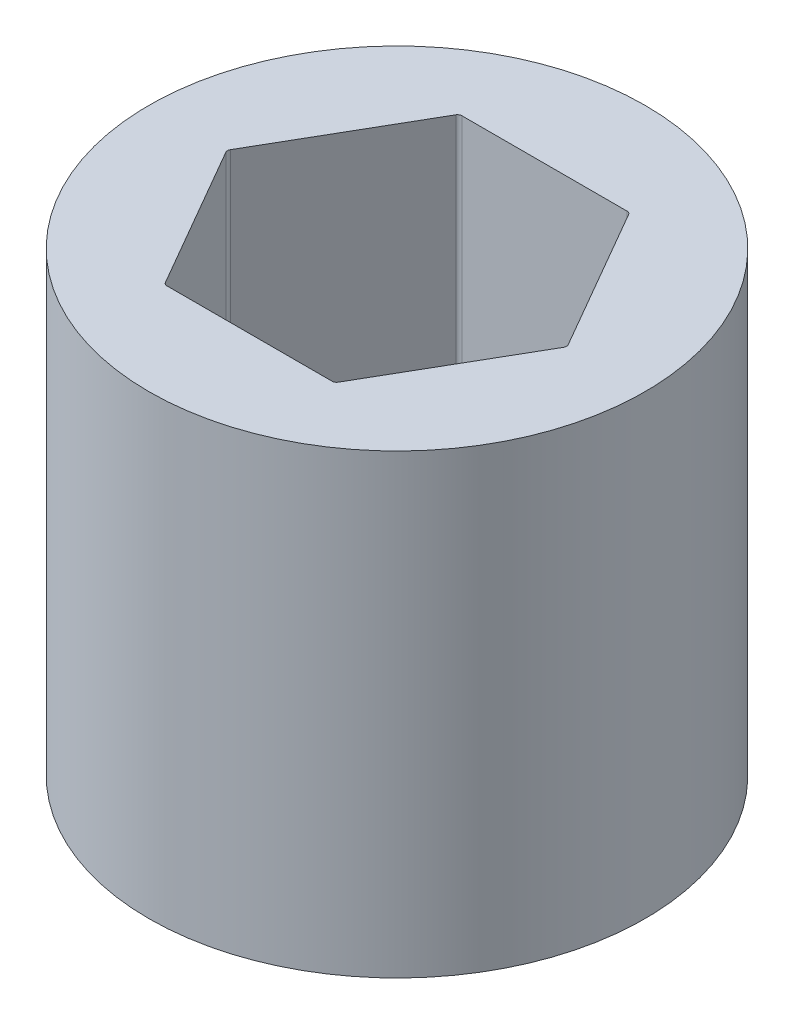
ISO-10303-21;
HEADER;
FILE_DESCRIPTION(('STEP AP214'),'2;1');
FILE_NAME('part.step','',(''),(''),'','','');
FILE_SCHEMA(('AUTOMOTIVE_DESIGN { 1 0 10303 214 1 1 1 1 }'));
ENDSEC;
DATA;
#1=APPLICATION_CONTEXT('core data for automotive mechanical design processes');
#2=APPLICATION_PROTOCOL_DEFINITION('international standard','automotive_design',2000,#1);
#3=PRODUCT_CONTEXT('',#1,'mechanical');
#4=PRODUCT('Part','Part','',(#3));
#5=PRODUCT_RELATED_PRODUCT_CATEGORY('part','',(#4));
#6=PRODUCT_DEFINITION_FORMATION('','',#4);
#7=PRODUCT_DEFINITION_CONTEXT('part definition',#1,'design');
#8=PRODUCT_DEFINITION('design','',#6,#7);
#9=PRODUCT_DEFINITION_SHAPE('','',#8);
#10=(LENGTH_UNIT() NAMED_UNIT(*) SI_UNIT(.MILLI.,.METRE.));
#11=(NAMED_UNIT(*) PLANE_ANGLE_UNIT() SI_UNIT($,.RADIAN.));
#12=(NAMED_UNIT(*) SI_UNIT($,.STERADIAN.) SOLID_ANGLE_UNIT());
#13=UNCERTAINTY_MEASURE_WITH_UNIT(LENGTH_MEASURE(1.E-05),#10,'distance_accuracy_value','');
#14=(GEOMETRIC_REPRESENTATION_CONTEXT(3) GLOBAL_UNCERTAINTY_ASSIGNED_CONTEXT((#13)) GLOBAL_UNIT_ASSIGNED_CONTEXT((#10,
#11,#12)) REPRESENTATION_CONTEXT('',''));
#15=CARTESIAN_POINT('',(0.,0.,0.));
#16=DIRECTION('',(0.,0.,1.));
#17=DIRECTION('',(1.,0.,0.));
#18=AXIS2_PLACEMENT_3D('',#15,#16,#17);
#19=CARTESIAN_POINT('',(0.,20.447,0.));
#20=DIRECTION('',(0.,1.,0.));
#21=DIRECTION('',(0.,0.,1.));
#22=AXIS2_PLACEMENT_3D('',#19,#20,#21);
#23=PLANE('',#22);
#24=CARTESIAN_POINT('',(0.,20.447,0.));
#25=DIRECTION('',(0.,1.,0.));
#26=DIRECTION('',(0.,0.,1.));
#27=AXIS2_PLACEMENT_3D('',#24,#25,#26);
#28=CIRCLE('',#27,11.1125);
#29=CARTESIAN_POINT('',(0.,20.447,11.1125));
#30=VERTEX_POINT('',#29);
#31=EDGE_CURVE('E149',#30,#30,#28,.T.);
#32=ORIENTED_EDGE('',*,*,#31,.T.);
#33=EDGE_LOOP('',(#32));
#34=FACE_BOUND('',#33,.T.);
#35=DIRECTION('',(-0.5,0.,-0.866025403784438));
#36=VECTOR('',#35,1.);
#37=CARTESIAN_POINT('',(7.62564235545658,20.447,0.));
#38=LINE('',#37,#36);
#39=CARTESIAN_POINT('',(7.56790732853761,20.447,-0.100000000000001));
#40=VERTEX_POINT('',#39);
#41=CARTESIAN_POINT('',(3.87055620464725,20.447,-6.504));
#42=VERTEX_POINT('',#41);
#43=EDGE_CURVE('E250',#40,#42,#38,.T.);
#44=ORIENTED_EDGE('',*,*,#43,.F.);
#45=CARTESIAN_POINT('',(7.39470224778073,20.447,0.));
#46=DIRECTION('',(0.,1.,0.));
#47=DIRECTION('',(0.,0.,1.));
#48=AXIS2_PLACEMENT_3D('',#45,#46,#47);
#49=CIRCLE('',#48,0.2);
#50=CARTESIAN_POINT('',(7.56790732853761,20.447,0.0999999999999977));
#51=VERTEX_POINT('',#50);
#52=EDGE_CURVE('E52',#40,#51,#49,.F.);
#53=ORIENTED_EDGE('',*,*,#52,.T.);
#54=DIRECTION('',(0.5,0.,-0.866025403784439));
#55=VECTOR('',#54,1.);
#56=CARTESIAN_POINT('',(3.81282117772829,20.447,6.604));
#57=LINE('',#56,#55);
#58=CARTESIAN_POINT('',(3.87055620464725,20.447,6.50400000000001));
#59=VERTEX_POINT('',#58);
#60=EDGE_CURVE('E208',#59,#51,#57,.T.);
#61=ORIENTED_EDGE('',*,*,#60,.F.);
#62=CARTESIAN_POINT('',(3.69735112389036,20.447,6.40400000000001));
#63=DIRECTION('',(0.,1.,0.));
#64=DIRECTION('',(0.,0.,1.));
#65=AXIS2_PLACEMENT_3D('',#62,#63,#64);
#66=CIRCLE('',#65,0.2);
#67=CARTESIAN_POINT('',(3.69735112389036,20.447,6.604));
#68=VERTEX_POINT('',#67);
#69=EDGE_CURVE('E137',#59,#68,#66,.F.);
#70=ORIENTED_EDGE('',*,*,#69,.T.);
#71=DIRECTION('',(1.,0.,0.));
#72=VECTOR('',#71,1.);
#73=CARTESIAN_POINT('',(-3.81282117772829,20.447,6.604));
#74=LINE('',#73,#72);
#75=CARTESIAN_POINT('',(-3.69735112389036,20.447,6.604));
#76=VERTEX_POINT('',#75);
#77=EDGE_CURVE('E215',#76,#68,#74,.T.);
#78=ORIENTED_EDGE('',*,*,#77,.F.);
#79=CARTESIAN_POINT('',(-3.69735112389036,20.447,6.40400000000001));
#80=DIRECTION('',(0.,1.,0.));
#81=DIRECTION('',(0.,0.,1.));
#82=AXIS2_PLACEMENT_3D('',#79,#80,#81);
#83=CIRCLE('',#82,0.2);
#84=CARTESIAN_POINT('',(-3.87055620464725,20.447,6.50400000000001));
#85=VERTEX_POINT('',#84);
#86=EDGE_CURVE('E11',#76,#85,#83,.F.);
#87=ORIENTED_EDGE('',*,*,#86,.T.);
#88=DIRECTION('',(0.5,0.,0.866025403784439));
#89=VECTOR('',#88,1.);
#90=CARTESIAN_POINT('',(-7.62564235545658,20.447,0.));
#91=LINE('',#90,#89);
#92=CARTESIAN_POINT('',(-7.56790732853762,20.447,0.1));
#93=VERTEX_POINT('',#92);
#94=EDGE_CURVE('E213',#93,#85,#91,.T.);
#95=ORIENTED_EDGE('',*,*,#94,.F.);
#96=CARTESIAN_POINT('',(-7.39470224778073,20.447,0.));
#97=DIRECTION('',(0.,1.,0.));
#98=DIRECTION('',(0.,0.,1.));
#99=AXIS2_PLACEMENT_3D('',#96,#97,#98);
#100=CIRCLE('',#99,0.2);
#101=CARTESIAN_POINT('',(-7.56790732853762,20.447,-0.0999999999999994));
#102=VERTEX_POINT('',#101);
#103=EDGE_CURVE('E190',#93,#102,#100,.F.);
#104=ORIENTED_EDGE('',*,*,#103,.T.);
#105=DIRECTION('',(-0.5,0.,0.866025403784439));
#106=VECTOR('',#105,1.);
#107=CARTESIAN_POINT('',(-3.81282117772829,20.447,-6.604));
#108=LINE('',#107,#106);
#109=CARTESIAN_POINT('',(-3.87055620464725,20.447,-6.504));
#110=VERTEX_POINT('',#109);
#111=EDGE_CURVE('E219',#110,#102,#108,.T.);
#112=ORIENTED_EDGE('',*,*,#111,.F.);
#113=CARTESIAN_POINT('',(-3.69735112389037,20.447,-6.404));
#114=DIRECTION('',(0.,1.,0.));
#115=DIRECTION('',(0.,0.,1.));
#116=AXIS2_PLACEMENT_3D('',#113,#114,#115);
#117=CIRCLE('',#116,0.2);
#118=CARTESIAN_POINT('',(-3.69735112389037,20.447,-6.604));
#119=VERTEX_POINT('',#118);
#120=EDGE_CURVE('E186',#110,#119,#117,.F.);
#121=ORIENTED_EDGE('',*,*,#120,.T.);
#122=DIRECTION('',(-1.,0.,0.));
#123=VECTOR('',#122,1.);
#124=CARTESIAN_POINT('',(3.81282117772829,20.447,-6.604));
#125=LINE('',#124,#123);
#126=CARTESIAN_POINT('',(3.69735112389036,20.447,-6.604));
#127=VERTEX_POINT('',#126);
#128=EDGE_CURVE('E223',#127,#119,#125,.T.);
#129=ORIENTED_EDGE('',*,*,#128,.F.);
#130=CARTESIAN_POINT('',(3.69735112389036,20.447,-6.404));
#131=DIRECTION('',(0.,1.,0.));
#132=DIRECTION('',(0.,0.,1.));
#133=AXIS2_PLACEMENT_3D('',#130,#131,#132);
#134=CIRCLE('',#133,0.2);
#135=EDGE_CURVE('E182',#127,#42,#134,.F.);
#136=ORIENTED_EDGE('',*,*,#135,.T.);
#137=EDGE_LOOP('',(#44,#53,#61,#70,#78,#87,#95,#104,#112,#121,#129,#136));
#138=FACE_BOUND('',#137,.T.);
#139=ADVANCED_FACE('F37',(#34,#138),#23,.T.);
#140=CARTESIAN_POINT('',(0.,0.,0.));
#141=DIRECTION('',(0.,1.,0.));
#142=DIRECTION('',(0.,0.,1.));
#143=AXIS2_PLACEMENT_3D('',#140,#141,#142);
#144=PLANE('',#143);
#145=CARTESIAN_POINT('',(0.,0.,0.));
#146=DIRECTION('',(0.,1.,0.));
#147=DIRECTION('',(0.,0.,1.));
#148=AXIS2_PLACEMENT_3D('',#145,#146,#147);
#149=CIRCLE('',#148,11.1125);
#150=CARTESIAN_POINT('',(0.,0.,11.1125));
#151=VERTEX_POINT('',#150);
#152=EDGE_CURVE('E154',#151,#151,#149,.T.);
#153=ORIENTED_EDGE('',*,*,#152,.F.);
#154=EDGE_LOOP('',(#153));
#155=FACE_BOUND('',#154,.T.);
#156=DIRECTION('',(1.,0.,0.));
#157=VECTOR('',#156,1.);
#158=CARTESIAN_POINT('',(-3.81282117772829,0.,6.604));
#159=LINE('',#158,#157);
#160=CARTESIAN_POINT('',(-3.69735112389036,0.,6.604));
#161=VERTEX_POINT('',#160);
#162=CARTESIAN_POINT('',(3.69735112389036,0.,6.604));
#163=VERTEX_POINT('',#162);
#164=EDGE_CURVE('E197',#161,#163,#159,.T.);
#165=ORIENTED_EDGE('',*,*,#164,.T.);
#166=CARTESIAN_POINT('',(3.69735112389036,0.,6.40400000000001));
#167=DIRECTION('',(0.,1.,0.));
#168=DIRECTION('',(0.,0.,1.));
#169=AXIS2_PLACEMENT_3D('',#166,#167,#168);
#170=CIRCLE('',#169,0.2);
#171=CARTESIAN_POINT('',(3.87055620464725,0.,6.50400000000001));
#172=VERTEX_POINT('',#171);
#173=EDGE_CURVE('E192',#163,#172,#170,.T.);
#174=ORIENTED_EDGE('',*,*,#173,.T.);
#175=DIRECTION('',(0.5,0.,-0.866025403784439));
#176=VECTOR('',#175,1.);
#177=CARTESIAN_POINT('',(3.81282117772829,0.,6.604));
#178=LINE('',#177,#176);
#179=CARTESIAN_POINT('',(7.56790732853761,0.,0.0999999999999977));
#180=VERTEX_POINT('',#179);
#181=EDGE_CURVE('E132',#172,#180,#178,.T.);
#182=ORIENTED_EDGE('',*,*,#181,.T.);
#183=CARTESIAN_POINT('',(7.39470224778073,0.,0.));
#184=DIRECTION('',(0.,1.,0.));
#185=DIRECTION('',(0.,0.,1.));
#186=AXIS2_PLACEMENT_3D('',#183,#184,#185);
#187=CIRCLE('',#186,0.2);
#188=CARTESIAN_POINT('',(7.56790732853761,0.,-0.100000000000001));
#189=VERTEX_POINT('',#188);
#190=EDGE_CURVE('E127',#180,#189,#187,.T.);
#191=ORIENTED_EDGE('',*,*,#190,.T.);
#192=DIRECTION('',(-0.5,0.,-0.866025403784438));
#193=VECTOR('',#192,1.);
#194=CARTESIAN_POINT('',(7.62564235545658,0.,0.));
#195=LINE('',#194,#193);
#196=CARTESIAN_POINT('',(3.87055620464725,0.,-6.504));
#197=VERTEX_POINT('',#196);
#198=EDGE_CURVE('E131',#189,#197,#195,.T.);
#199=ORIENTED_EDGE('',*,*,#198,.T.);
#200=CARTESIAN_POINT('',(3.69735112389036,0.,-6.404));
#201=DIRECTION('',(0.,1.,0.));
#202=DIRECTION('',(0.,0.,1.));
#203=AXIS2_PLACEMENT_3D('',#200,#201,#202);
#204=CIRCLE('',#203,0.2);
#205=CARTESIAN_POINT('',(3.69735112389036,0.,-6.604));
#206=VERTEX_POINT('',#205);
#207=EDGE_CURVE('E180',#197,#206,#204,.T.);
#208=ORIENTED_EDGE('',*,*,#207,.T.);
#209=DIRECTION('',(-1.,0.,0.));
#210=VECTOR('',#209,1.);
#211=CARTESIAN_POINT('',(3.81282117772829,0.,-6.604));
#212=LINE('',#211,#210);
#213=CARTESIAN_POINT('',(-3.69735112389037,0.,-6.604));
#214=VERTEX_POINT('',#213);
#215=EDGE_CURVE('E146',#206,#214,#212,.T.);
#216=ORIENTED_EDGE('',*,*,#215,.T.);
#217=CARTESIAN_POINT('',(-3.69735112389037,0.,-6.404));
#218=DIRECTION('',(0.,1.,0.));
#219=DIRECTION('',(0.,0.,1.));
#220=AXIS2_PLACEMENT_3D('',#217,#218,#219);
#221=CIRCLE('',#220,0.2);
#222=CARTESIAN_POINT('',(-3.87055620464725,0.,-6.504));
#223=VERTEX_POINT('',#222);
#224=EDGE_CURVE('E184',#214,#223,#221,.T.);
#225=ORIENTED_EDGE('',*,*,#224,.T.);
#226=DIRECTION('',(-0.5,0.,0.866025403784439));
#227=VECTOR('',#226,1.);
#228=CARTESIAN_POINT('',(-3.81282117772829,0.,-6.604));
#229=LINE('',#228,#227);
#230=CARTESIAN_POINT('',(-7.56790732853762,0.,-0.0999999999999994));
#231=VERTEX_POINT('',#230);
#232=EDGE_CURVE('E230',#223,#231,#229,.T.);
#233=ORIENTED_EDGE('',*,*,#232,.T.);
#234=CARTESIAN_POINT('',(-7.39470224778073,0.,0.));
#235=DIRECTION('',(0.,1.,0.));
#236=DIRECTION('',(0.,0.,1.));
#237=AXIS2_PLACEMENT_3D('',#234,#235,#236);
#238=CIRCLE('',#237,0.2);
#239=CARTESIAN_POINT('',(-7.56790732853762,0.,0.1));
#240=VERTEX_POINT('',#239);
#241=EDGE_CURVE('E188',#231,#240,#238,.T.);
#242=ORIENTED_EDGE('',*,*,#241,.T.);
#243=DIRECTION('',(0.5,0.,0.866025403784439));
#244=VECTOR('',#243,1.);
#245=CARTESIAN_POINT('',(-7.62564235545658,0.,0.));
#246=LINE('',#245,#244);
#247=CARTESIAN_POINT('',(-3.87055620464725,0.,6.50400000000001));
#248=VERTEX_POINT('',#247);
#249=EDGE_CURVE('E199',#240,#248,#246,.T.);
#250=ORIENTED_EDGE('',*,*,#249,.T.);
#251=CARTESIAN_POINT('',(-3.69735112389036,0.,6.40400000000001));
#252=DIRECTION('',(0.,1.,0.));
#253=DIRECTION('',(0.,0.,1.));
#254=AXIS2_PLACEMENT_3D('',#251,#252,#253);
#255=CIRCLE('',#254,0.2);
#256=EDGE_CURVE('E45',#248,#161,#255,.T.);
#257=ORIENTED_EDGE('',*,*,#256,.T.);
#258=EDGE_LOOP('',(#165,#174,#182,#191,#199,#208,#216,#225,#233,#242,#250,#257));
#259=FACE_BOUND('',#258,.T.);
#260=ADVANCED_FACE('F130',(#155,#259),#144,.F.);
#261=CARTESIAN_POINT('',(0.,20.447,0.));
#262=DIRECTION('',(0.,-1.,0.));
#263=DIRECTION('',(0.,0.,-1.));
#264=AXIS2_PLACEMENT_3D('',#261,#262,#263);
#265=CYLINDRICAL_SURFACE('',#264,11.1125);
#266=ORIENTED_EDGE('',*,*,#31,.F.);
#267=EDGE_LOOP('',(#266));
#268=FACE_BOUND('',#267,.T.);
#269=ORIENTED_EDGE('',*,*,#152,.T.);
#270=EDGE_LOOP('',(#269));
#271=FACE_BOUND('',#270,.T.);
#272=ADVANCED_FACE('F272',(#268,#271),#265,.T.);
#273=CARTESIAN_POINT('',(3.81282117772829,20.447,6.604));
#274=DIRECTION('',(-0.866025403784439,0.,-0.5));
#275=DIRECTION('',(-0.5,0.,0.866025403784439));
#276=AXIS2_PLACEMENT_3D('',#273,#274,#275);
#277=PLANE('',#276);
#278=ORIENTED_EDGE('',*,*,#181,.F.);
#279=DIRECTION('',(0.,-1.,0.));
#280=VECTOR('',#279,1.);
#281=CARTESIAN_POINT('',(3.87055620464725,20.447,6.50400000000001));
#282=LINE('',#281,#280);
#283=EDGE_CURVE('E59',#172,#59,#282,.F.);
#284=ORIENTED_EDGE('',*,*,#283,.T.);
#285=ORIENTED_EDGE('',*,*,#60,.T.);
#286=DIRECTION('',(0.,-1.,0.));
#287=VECTOR('',#286,1.);
#288=CARTESIAN_POINT('',(7.56790732853762,0.,0.0999999999999983));
#289=LINE('',#288,#287);
#290=EDGE_CURVE('E177',#51,#180,#289,.T.);
#291=ORIENTED_EDGE('',*,*,#290,.T.);
#292=EDGE_LOOP('',(#278,#284,#285,#291));
#293=FACE_BOUND('',#292,.T.);
#294=ADVANCED_FACE('F253',(#293),#277,.T.);
#295=CARTESIAN_POINT('',(7.62564235545658,20.447,0.));
#296=DIRECTION('',(-0.866025403784438,0.,0.5));
#297=DIRECTION('',(0.5,0.,0.866025403784439));
#298=AXIS2_PLACEMENT_3D('',#295,#296,#297);
#299=PLANE('',#298);
#300=ORIENTED_EDGE('',*,*,#43,.T.);
#301=DIRECTION('',(0.,-1.,0.));
#302=VECTOR('',#301,1.);
#303=CARTESIAN_POINT('',(3.87055620464725,0.,-6.504));
#304=LINE('',#303,#302);
#305=EDGE_CURVE('E145',#42,#197,#304,.T.);
#306=ORIENTED_EDGE('',*,*,#305,.T.);
#307=ORIENTED_EDGE('',*,*,#198,.F.);
#308=DIRECTION('',(0.,-1.,0.));
#309=VECTOR('',#308,1.);
#310=CARTESIAN_POINT('',(7.56790732853761,20.447,-0.100000000000002));
#311=LINE('',#310,#309);
#312=EDGE_CURVE('E143',#189,#40,#311,.F.);
#313=ORIENTED_EDGE('',*,*,#312,.T.);
#314=EDGE_LOOP('',(#300,#306,#307,#313));
#315=FACE_BOUND('',#314,.T.);
#316=ADVANCED_FACE('F142',(#315),#299,.T.);
#317=CARTESIAN_POINT('',(3.81282117772829,20.447,-6.604));
#318=DIRECTION('',(0.,0.,1.));
#319=DIRECTION('',(1.,0.,0.));
#320=AXIS2_PLACEMENT_3D('',#317,#318,#319);
#321=PLANE('',#320);
#322=ORIENTED_EDGE('',*,*,#215,.F.);
#323=DIRECTION('',(0.,-1.,0.));
#324=VECTOR('',#323,1.);
#325=CARTESIAN_POINT('',(3.69735112389036,20.447,-6.604));
#326=LINE('',#325,#324);
#327=EDGE_CURVE('E160',#206,#127,#326,.F.);
#328=ORIENTED_EDGE('',*,*,#327,.T.);
#329=ORIENTED_EDGE('',*,*,#128,.T.);
#330=DIRECTION('',(0.,-1.,0.));
#331=VECTOR('',#330,1.);
#332=CARTESIAN_POINT('',(-3.69735112389037,0.,-6.604));
#333=LINE('',#332,#331);
#334=EDGE_CURVE('E151',#119,#214,#333,.T.);
#335=ORIENTED_EDGE('',*,*,#334,.T.);
#336=EDGE_LOOP('',(#322,#328,#329,#335));
#337=FACE_BOUND('',#336,.T.);
#338=ADVANCED_FACE('F248',(#337),#321,.T.);
#339=CARTESIAN_POINT('',(-3.81282117772829,20.447,-6.604));
#340=DIRECTION('',(0.866025403784439,0.,0.5));
#341=DIRECTION('',(0.5,0.,-0.866025403784439));
#342=AXIS2_PLACEMENT_3D('',#339,#340,#341);
#343=PLANE('',#342);
#344=ORIENTED_EDGE('',*,*,#232,.F.);
#345=DIRECTION('',(0.,-1.,0.));
#346=VECTOR('',#345,1.);
#347=CARTESIAN_POINT('',(-3.87055620464725,20.447,-6.504));
#348=LINE('',#347,#346);
#349=EDGE_CURVE('E165',#223,#110,#348,.F.);
#350=ORIENTED_EDGE('',*,*,#349,.T.);
#351=ORIENTED_EDGE('',*,*,#111,.T.);
#352=DIRECTION('',(0.,-1.,0.));
#353=VECTOR('',#352,1.);
#354=CARTESIAN_POINT('',(-7.56790732853762,0.,-0.0999999999999989));
#355=LINE('',#354,#353);
#356=EDGE_CURVE('E162',#102,#231,#355,.T.);
#357=ORIENTED_EDGE('',*,*,#356,.T.);
#358=EDGE_LOOP('',(#344,#350,#351,#357));
#359=FACE_BOUND('',#358,.T.);
#360=ADVANCED_FACE('F236',(#359),#343,.T.);
#361=CARTESIAN_POINT('',(-7.62564235545658,20.447,0.));
#362=DIRECTION('',(0.866025403784439,0.,-0.5));
#363=DIRECTION('',(-0.5,0.,-0.866025403784439));
#364=AXIS2_PLACEMENT_3D('',#361,#362,#363);
#365=PLANE('',#364);
#366=ORIENTED_EDGE('',*,*,#249,.F.);
#367=DIRECTION('',(0.,-1.,0.));
#368=VECTOR('',#367,1.);
#369=CARTESIAN_POINT('',(-7.56790732853762,20.447,0.1));
#370=LINE('',#369,#368);
#371=EDGE_CURVE('E170',#240,#93,#370,.F.);
#372=ORIENTED_EDGE('',*,*,#371,.T.);
#373=ORIENTED_EDGE('',*,*,#94,.T.);
#374=DIRECTION('',(0.,-1.,0.));
#375=VECTOR('',#374,1.);
#376=CARTESIAN_POINT('',(-3.87055620464725,0.,6.504));
#377=LINE('',#376,#375);
#378=EDGE_CURVE('E167',#85,#248,#377,.T.);
#379=ORIENTED_EDGE('',*,*,#378,.T.);
#380=EDGE_LOOP('',(#366,#372,#373,#379));
#381=FACE_BOUND('',#380,.T.);
#382=ADVANCED_FACE('F217',(#381),#365,.T.);
#383=CARTESIAN_POINT('',(-3.81282117772829,20.447,6.604));
#384=DIRECTION('',(0.,0.,-1.));
#385=DIRECTION('',(-1.,0.,0.));
#386=AXIS2_PLACEMENT_3D('',#383,#384,#385);
#387=PLANE('',#386);
#388=ORIENTED_EDGE('',*,*,#77,.T.);
#389=DIRECTION('',(0.,-1.,0.));
#390=VECTOR('',#389,1.);
#391=CARTESIAN_POINT('',(3.69735112389036,0.,6.604));
#392=LINE('',#391,#390);
#393=EDGE_CURVE('E174',#68,#163,#392,.T.);
#394=ORIENTED_EDGE('',*,*,#393,.T.);
#395=ORIENTED_EDGE('',*,*,#164,.F.);
#396=DIRECTION('',(0.,-1.,0.));
#397=VECTOR('',#396,1.);
#398=CARTESIAN_POINT('',(-3.69735112389036,20.447,6.604));
#399=LINE('',#398,#397);
#400=EDGE_CURVE('E172',#161,#76,#399,.F.);
#401=ORIENTED_EDGE('',*,*,#400,.T.);
#402=EDGE_LOOP('',(#388,#394,#395,#401));
#403=FACE_BOUND('',#402,.T.);
#404=ADVANCED_FACE('F205',(#403),#387,.T.);
#405=CARTESIAN_POINT('',(3.69735112389036,20.447,-6.404));
#406=DIRECTION('',(0.,1.,0.));
#407=DIRECTION('',(0.,0.,1.));
#408=AXIS2_PLACEMENT_3D('',#405,#406,#407);
#409=CYLINDRICAL_SURFACE('',#408,0.2);
#410=ORIENTED_EDGE('',*,*,#135,.F.);
#411=ORIENTED_EDGE('',*,*,#327,.F.);
#412=ORIENTED_EDGE('',*,*,#207,.F.);
#413=ORIENTED_EDGE('',*,*,#305,.F.);
#414=EDGE_LOOP('',(#410,#411,#412,#413));
#415=FACE_BOUND('',#414,.T.);
#416=ADVANCED_FACE('F281',(#415),#409,.F.);
#417=CARTESIAN_POINT('',(-3.69735112389037,20.447,-6.404));
#418=DIRECTION('',(0.,1.,0.));
#419=DIRECTION('',(0.,0.,1.));
#420=AXIS2_PLACEMENT_3D('',#417,#418,#419);
#421=CYLINDRICAL_SURFACE('',#420,0.2);
#422=ORIENTED_EDGE('',*,*,#120,.F.);
#423=ORIENTED_EDGE('',*,*,#349,.F.);
#424=ORIENTED_EDGE('',*,*,#224,.F.);
#425=ORIENTED_EDGE('',*,*,#334,.F.);
#426=EDGE_LOOP('',(#422,#423,#424,#425));
#427=FACE_BOUND('',#426,.T.);
#428=ADVANCED_FACE('F241',(#427),#421,.F.);
#429=CARTESIAN_POINT('',(-7.39470224778073,20.447,0.));
#430=DIRECTION('',(0.,1.,0.));
#431=DIRECTION('',(0.,0.,1.));
#432=AXIS2_PLACEMENT_3D('',#429,#430,#431);
#433=CYLINDRICAL_SURFACE('',#432,0.2);
#434=ORIENTED_EDGE('',*,*,#103,.F.);
#435=ORIENTED_EDGE('',*,*,#371,.F.);
#436=ORIENTED_EDGE('',*,*,#241,.F.);
#437=ORIENTED_EDGE('',*,*,#356,.F.);
#438=EDGE_LOOP('',(#434,#435,#436,#437));
#439=FACE_BOUND('',#438,.T.);
#440=ADVANCED_FACE('F258',(#439),#433,.F.);
#441=CARTESIAN_POINT('',(3.69735112389036,20.447,6.40400000000001));
#442=DIRECTION('',(0.,1.,0.));
#443=DIRECTION('',(0.,0.,1.));
#444=AXIS2_PLACEMENT_3D('',#441,#442,#443);
#445=CYLINDRICAL_SURFACE('',#444,0.2);
#446=ORIENTED_EDGE('',*,*,#69,.F.);
#447=ORIENTED_EDGE('',*,*,#283,.F.);
#448=ORIENTED_EDGE('',*,*,#173,.F.);
#449=ORIENTED_EDGE('',*,*,#393,.F.);
#450=EDGE_LOOP('',(#446,#447,#448,#449));
#451=FACE_BOUND('',#450,.T.);
#452=ADVANCED_FACE('F256',(#451),#445,.F.);
#453=CARTESIAN_POINT('',(7.39470224778073,20.447,0.));
#454=DIRECTION('',(0.,1.,0.));
#455=DIRECTION('',(0.,0.,1.));
#456=AXIS2_PLACEMENT_3D('',#453,#454,#455);
#457=CYLINDRICAL_SURFACE('',#456,0.2);
#458=ORIENTED_EDGE('',*,*,#52,.F.);
#459=ORIENTED_EDGE('',*,*,#312,.F.);
#460=ORIENTED_EDGE('',*,*,#190,.F.);
#461=ORIENTED_EDGE('',*,*,#290,.F.);
#462=EDGE_LOOP('',(#458,#459,#460,#461));
#463=FACE_BOUND('',#462,.T.);
#464=ADVANCED_FACE('F148',(#463),#457,.F.);
#465=CARTESIAN_POINT('',(-3.69735112389036,20.447,6.40400000000001));
#466=DIRECTION('',(0.,1.,0.));
#467=DIRECTION('',(0.,0.,1.));
#468=AXIS2_PLACEMENT_3D('',#465,#466,#467);
#469=CYLINDRICAL_SURFACE('',#468,0.2);
#470=ORIENTED_EDGE('',*,*,#86,.F.);
#471=ORIENTED_EDGE('',*,*,#400,.F.);
#472=ORIENTED_EDGE('',*,*,#256,.F.);
#473=ORIENTED_EDGE('',*,*,#378,.F.);
#474=EDGE_LOOP('',(#470,#471,#472,#473));
#475=FACE_BOUND('',#474,.T.);
#476=ADVANCED_FACE('F39',(#475),#469,.F.);
#477=CLOSED_SHELL('',(#139,#260,#272,#294,#316,#338,#360,#382,#404,#416,#428,#440,#452,#464,#476));
#478=MANIFOLD_SOLID_BREP('B2',#477);
#479=ADVANCED_BREP_SHAPE_REPRESENTATION('',(#18,#478),#14);
#480=SHAPE_DEFINITION_REPRESENTATION(#9,#479);
ENDSEC;
END-ISO-10303-21;
